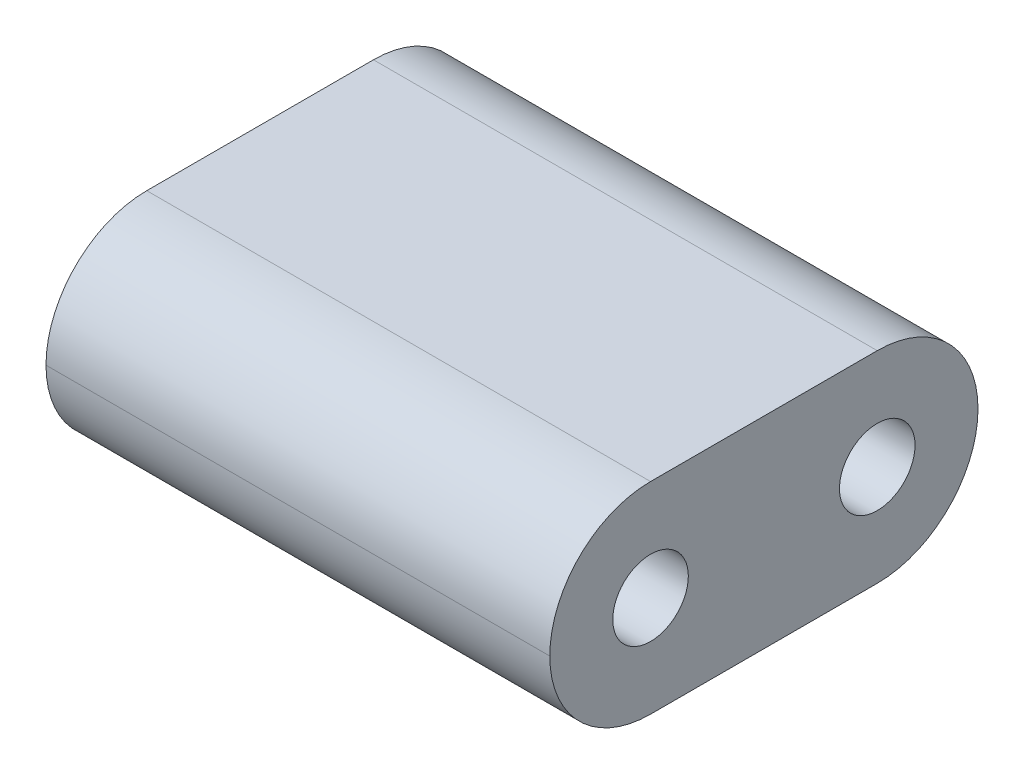
ISO-10303-21;
HEADER;
FILE_DESCRIPTION(('STEP AP214'),'2;1');
FILE_NAME('part.step','',(''),(''),'','','');
FILE_SCHEMA(('AUTOMOTIVE_DESIGN { 1 0 10303 214 1 1 1 1 }'));
ENDSEC;
DATA;
#1=APPLICATION_CONTEXT('core data for automotive mechanical design processes');
#2=APPLICATION_PROTOCOL_DEFINITION('international standard','automotive_design',2000,#1);
#3=PRODUCT_CONTEXT('',#1,'mechanical');
#4=PRODUCT('Part','Part','',(#3));
#5=PRODUCT_RELATED_PRODUCT_CATEGORY('part','',(#4));
#6=PRODUCT_DEFINITION_FORMATION('','',#4);
#7=PRODUCT_DEFINITION_CONTEXT('part definition',#1,'design');
#8=PRODUCT_DEFINITION('design','',#6,#7);
#9=PRODUCT_DEFINITION_SHAPE('','',#8);
#10=(LENGTH_UNIT() NAMED_UNIT(*) SI_UNIT(.MILLI.,.METRE.));
#11=(NAMED_UNIT(*) PLANE_ANGLE_UNIT() SI_UNIT($,.RADIAN.));
#12=(NAMED_UNIT(*) SI_UNIT($,.STERADIAN.) SOLID_ANGLE_UNIT());
#13=UNCERTAINTY_MEASURE_WITH_UNIT(LENGTH_MEASURE(1.E-05),#10,'distance_accuracy_value','');
#14=(GEOMETRIC_REPRESENTATION_CONTEXT(3) GLOBAL_UNCERTAINTY_ASSIGNED_CONTEXT((#13)) GLOBAL_UNIT_ASSIGNED_CONTEXT((#10,
#11,#12)) REPRESENTATION_CONTEXT('',''));
#15=CARTESIAN_POINT('',(0.,0.,0.));
#16=DIRECTION('',(0.,0.,1.));
#17=DIRECTION('',(1.,0.,0.));
#18=AXIS2_PLACEMENT_3D('',#15,#16,#17);
#19=CARTESIAN_POINT('',(0.,5.08,0.));
#20=DIRECTION('',(1.,0.,0.));
#21=DIRECTION('',(0.,0.,-1.));
#22=AXIS2_PLACEMENT_3D('',#19,#20,#21);
#23=PLANE('',#22);
#24=CARTESIAN_POINT('',(0.,2.54,-8.255));
#25=DIRECTION('',(1.,0.,0.));
#26=DIRECTION('',(0.,0.,-1.));
#27=AXIS2_PLACEMENT_3D('',#24,#25,#26);
#28=CIRCLE('',#27,0.9525);
#29=CARTESIAN_POINT('',(0.,2.54,-9.2075));
#30=VERTEX_POINT('',#29);
#31=EDGE_CURVE('E126',#30,#30,#28,.F.);
#32=ORIENTED_EDGE('',*,*,#31,.F.);
#33=EDGE_LOOP('',(#32));
#34=FACE_BOUND('',#33,.T.);
#35=CARTESIAN_POINT('',(0.,2.54,-2.53999999999999));
#36=DIRECTION('',(1.,0.,0.));
#37=DIRECTION('',(0.,0.,-1.));
#38=AXIS2_PLACEMENT_3D('',#35,#36,#37);
#39=CIRCLE('',#38,0.9525);
#40=CARTESIAN_POINT('',(0.,2.54,-3.49249999999999));
#41=VERTEX_POINT('',#40);
#42=EDGE_CURVE('E139',#41,#41,#39,.F.);
#43=ORIENTED_EDGE('',*,*,#42,.F.);
#44=EDGE_LOOP('',(#43));
#45=FACE_BOUND('',#44,.T.);
#46=CARTESIAN_POINT('',(0.,2.54,-8.255));
#47=DIRECTION('',(1.,0.,0.));
#48=DIRECTION('',(0.,0.,-1.));
#49=AXIS2_PLACEMENT_3D('',#46,#47,#48);
#50=CIRCLE('',#49,2.54);
#51=CARTESIAN_POINT('',(0.,5.08,-8.255));
#52=VERTEX_POINT('',#51);
#53=CARTESIAN_POINT('',(0.,2.54,-10.795));
#54=VERTEX_POINT('',#53);
#55=EDGE_CURVE('E110',#52,#54,#50,.F.);
#56=ORIENTED_EDGE('',*,*,#55,.T.);
#57=CARTESIAN_POINT('',(0.,2.54,-8.255));
#58=DIRECTION('',(1.,0.,0.));
#59=DIRECTION('',(0.,0.,-1.));
#60=AXIS2_PLACEMENT_3D('',#57,#58,#59);
#61=CIRCLE('',#60,2.54);
#62=CARTESIAN_POINT('',(0.,0.,-8.255));
#63=VERTEX_POINT('',#62);
#64=EDGE_CURVE('E105',#54,#63,#61,.F.);
#65=ORIENTED_EDGE('',*,*,#64,.T.);
#66=DIRECTION('',(0.,0.,1.));
#67=VECTOR('',#66,1.);
#68=CARTESIAN_POINT('',(0.,0.,0.));
#69=LINE('',#68,#67);
#70=CARTESIAN_POINT('',(0.,0.,-2.54));
#71=VERTEX_POINT('',#70);
#72=EDGE_CURVE('E107',#63,#71,#69,.T.);
#73=ORIENTED_EDGE('',*,*,#72,.T.);
#74=CARTESIAN_POINT('',(0.,2.54,-2.54));
#75=DIRECTION('',(1.,0.,0.));
#76=DIRECTION('',(0.,0.,-1.));
#77=AXIS2_PLACEMENT_3D('',#74,#75,#76);
#78=CIRCLE('',#77,2.54);
#79=CARTESIAN_POINT('',(0.,2.54,0.));
#80=VERTEX_POINT('',#79);
#81=EDGE_CURVE('E147',#71,#80,#78,.F.);
#82=ORIENTED_EDGE('',*,*,#81,.T.);
#83=CARTESIAN_POINT('',(0.,2.54,-2.54));
#84=DIRECTION('',(1.,0.,0.));
#85=DIRECTION('',(0.,0.,-1.));
#86=AXIS2_PLACEMENT_3D('',#83,#84,#85);
#87=CIRCLE('',#86,2.54);
#88=CARTESIAN_POINT('',(0.,5.08,-2.54));
#89=VERTEX_POINT('',#88);
#90=EDGE_CURVE('E151',#80,#89,#87,.F.);
#91=ORIENTED_EDGE('',*,*,#90,.T.);
#92=DIRECTION('',(0.,0.,1.));
#93=VECTOR('',#92,1.);
#94=CARTESIAN_POINT('',(0.,5.08,0.));
#95=LINE('',#94,#93);
#96=EDGE_CURVE('E156',#52,#89,#95,.T.);
#97=ORIENTED_EDGE('',*,*,#96,.F.);
#98=EDGE_LOOP('',(#56,#65,#73,#82,#91,#97));
#99=FACE_BOUND('',#98,.T.);
#100=ADVANCED_FACE('F51',(#34,#45,#99),#23,.F.);
#101=CARTESIAN_POINT('',(12.7,5.08,0.));
#102=DIRECTION('',(-1.,0.,0.));
#103=DIRECTION('',(0.,0.,1.));
#104=AXIS2_PLACEMENT_3D('',#101,#102,#103);
#105=PLANE('',#104);
#106=CARTESIAN_POINT('',(12.7,2.54,-8.255));
#107=DIRECTION('',(1.,0.,0.));
#108=DIRECTION('',(0.,0.,-1.));
#109=AXIS2_PLACEMENT_3D('',#106,#107,#108);
#110=CIRCLE('',#109,0.9525);
#111=CARTESIAN_POINT('',(12.7,2.54,-9.2075));
#112=VERTEX_POINT('',#111);
#113=EDGE_CURVE('E163',#112,#112,#110,.T.);
#114=ORIENTED_EDGE('',*,*,#113,.F.);
#115=EDGE_LOOP('',(#114));
#116=FACE_BOUND('',#115,.T.);
#117=CARTESIAN_POINT('',(12.7,2.54,-2.54));
#118=DIRECTION('',(1.,0.,0.));
#119=DIRECTION('',(0.,0.,-1.));
#120=AXIS2_PLACEMENT_3D('',#117,#118,#119);
#121=CIRCLE('',#120,0.9525);
#122=CARTESIAN_POINT('',(12.7,2.54,-3.4925));
#123=VERTEX_POINT('',#122);
#124=EDGE_CURVE('E141',#123,#123,#121,.T.);
#125=ORIENTED_EDGE('',*,*,#124,.F.);
#126=EDGE_LOOP('',(#125));
#127=FACE_BOUND('',#126,.T.);
#128=DIRECTION('',(0.,0.,-1.));
#129=VECTOR('',#128,1.);
#130=CARTESIAN_POINT('',(12.7,0.,0.));
#131=LINE('',#130,#129);
#132=CARTESIAN_POINT('',(12.7,0.,-2.54));
#133=VERTEX_POINT('',#132);
#134=CARTESIAN_POINT('',(12.7,0.,-8.255));
#135=VERTEX_POINT('',#134);
#136=EDGE_CURVE('E125',#133,#135,#131,.T.);
#137=ORIENTED_EDGE('',*,*,#136,.T.);
#138=CARTESIAN_POINT('',(12.7,2.54,-8.255));
#139=DIRECTION('',(-1.,0.,0.));
#140=DIRECTION('',(0.,0.,1.));
#141=AXIS2_PLACEMENT_3D('',#138,#139,#140);
#142=CIRCLE('',#141,2.54);
#143=CARTESIAN_POINT('',(12.7,2.54,-10.795));
#144=VERTEX_POINT('',#143);
#145=EDGE_CURVE('E129',#135,#144,#142,.F.);
#146=ORIENTED_EDGE('',*,*,#145,.T.);
#147=CARTESIAN_POINT('',(12.7,2.54,-8.255));
#148=DIRECTION('',(-1.,0.,0.));
#149=DIRECTION('',(0.,0.,1.));
#150=AXIS2_PLACEMENT_3D('',#147,#148,#149);
#151=CIRCLE('',#150,2.54);
#152=CARTESIAN_POINT('',(12.7,5.08,-8.255));
#153=VERTEX_POINT('',#152);
#154=EDGE_CURVE('E74',#144,#153,#151,.F.);
#155=ORIENTED_EDGE('',*,*,#154,.T.);
#156=DIRECTION('',(0.,0.,-1.));
#157=VECTOR('',#156,1.);
#158=CARTESIAN_POINT('',(12.7,5.08,0.));
#159=LINE('',#158,#157);
#160=CARTESIAN_POINT('',(12.7,5.08,-2.54));
#161=VERTEX_POINT('',#160);
#162=EDGE_CURVE('E153',#161,#153,#159,.T.);
#163=ORIENTED_EDGE('',*,*,#162,.F.);
#164=CARTESIAN_POINT('',(12.7,2.54,-2.54));
#165=DIRECTION('',(-1.,0.,0.));
#166=DIRECTION('',(0.,0.,1.));
#167=AXIS2_PLACEMENT_3D('',#164,#165,#166);
#168=CIRCLE('',#167,2.54);
#169=CARTESIAN_POINT('',(12.7,2.54,0.));
#170=VERTEX_POINT('',#169);
#171=EDGE_CURVE('E68',#161,#170,#168,.F.);
#172=ORIENTED_EDGE('',*,*,#171,.T.);
#173=CARTESIAN_POINT('',(12.7,2.54,-2.54));
#174=DIRECTION('',(-1.,0.,0.));
#175=DIRECTION('',(0.,0.,1.));
#176=AXIS2_PLACEMENT_3D('',#173,#174,#175);
#177=CIRCLE('',#176,2.54);
#178=EDGE_CURVE('E131',#170,#133,#177,.F.);
#179=ORIENTED_EDGE('',*,*,#178,.T.);
#180=EDGE_LOOP('',(#137,#146,#155,#163,#172,#179));
#181=FACE_BOUND('',#180,.T.);
#182=ADVANCED_FACE('F173',(#116,#127,#181),#105,.F.);
#183=CARTESIAN_POINT('',(0.,5.08,0.));
#184=DIRECTION('',(0.,-1.,0.));
#185=DIRECTION('',(0.,0.,-1.));
#186=AXIS2_PLACEMENT_3D('',#183,#184,#185);
#187=PLANE('',#186);
#188=ORIENTED_EDGE('',*,*,#162,.T.);
#189=DIRECTION('',(-1.,0.,0.));
#190=VECTOR('',#189,1.);
#191=CARTESIAN_POINT('',(0.,5.08,-8.255));
#192=LINE('',#191,#190);
#193=EDGE_CURVE('E12',#153,#52,#192,.T.);
#194=ORIENTED_EDGE('',*,*,#193,.T.);
#195=ORIENTED_EDGE('',*,*,#96,.T.);
#196=DIRECTION('',(1.,0.,0.));
#197=VECTOR('',#196,1.);
#198=CARTESIAN_POINT('',(0.,5.08,-2.54));
#199=LINE('',#198,#197);
#200=EDGE_CURVE('E60',#89,#161,#199,.T.);
#201=ORIENTED_EDGE('',*,*,#200,.T.);
#202=EDGE_LOOP('',(#188,#194,#195,#201));
#203=FACE_BOUND('',#202,.T.);
#204=ADVANCED_FACE('F176',(#203),#187,.F.);
#205=CARTESIAN_POINT('',(0.,0.,0.));
#206=DIRECTION('',(0.,-1.,0.));
#207=DIRECTION('',(0.,0.,-1.));
#208=AXIS2_PLACEMENT_3D('',#205,#206,#207);
#209=PLANE('',#208);
#210=ORIENTED_EDGE('',*,*,#72,.F.);
#211=DIRECTION('',(-1.,0.,0.));
#212=VECTOR('',#211,1.);
#213=CARTESIAN_POINT('',(12.7,0.,-8.255));
#214=LINE('',#213,#212);
#215=EDGE_CURVE('E122',#63,#135,#214,.F.);
#216=ORIENTED_EDGE('',*,*,#215,.T.);
#217=ORIENTED_EDGE('',*,*,#136,.F.);
#218=DIRECTION('',(1.,0.,0.));
#219=VECTOR('',#218,1.);
#220=CARTESIAN_POINT('',(0.,0.,-2.54));
#221=LINE('',#220,#219);
#222=EDGE_CURVE('E115',#133,#71,#221,.F.);
#223=ORIENTED_EDGE('',*,*,#222,.T.);
#224=EDGE_LOOP('',(#210,#216,#217,#223));
#225=FACE_BOUND('',#224,.T.);
#226=ADVANCED_FACE('F120',(#225),#209,.T.);
#227=CARTESIAN_POINT('',(-0.000999999999999265,2.54,-2.53999999999999));
#228=DIRECTION('',(1.,0.,0.));
#229=DIRECTION('',(0.,0.,-1.));
#230=AXIS2_PLACEMENT_3D('',#227,#228,#229);
#231=CYLINDRICAL_SURFACE('',#230,0.9525);
#232=ORIENTED_EDGE('',*,*,#124,.T.);
#233=EDGE_LOOP('',(#232));
#234=FACE_BOUND('',#233,.T.);
#235=ORIENTED_EDGE('',*,*,#42,.T.);
#236=EDGE_LOOP('',(#235));
#237=FACE_BOUND('',#236,.T.);
#238=ADVANCED_FACE('F188',(#234,#237),#231,.F.);
#239=CARTESIAN_POINT('',(-0.001000000000001,2.54,-8.255));
#240=DIRECTION('',(1.,0.,0.));
#241=DIRECTION('',(0.,0.,-1.));
#242=AXIS2_PLACEMENT_3D('',#239,#240,#241);
#243=CYLINDRICAL_SURFACE('',#242,0.9525);
#244=ORIENTED_EDGE('',*,*,#113,.T.);
#245=EDGE_LOOP('',(#244));
#246=FACE_BOUND('',#245,.T.);
#247=ORIENTED_EDGE('',*,*,#31,.T.);
#248=EDGE_LOOP('',(#247));
#249=FACE_BOUND('',#248,.T.);
#250=ADVANCED_FACE('F170',(#246,#249),#243,.F.);
#251=CARTESIAN_POINT('',(0.,2.54,-8.255));
#252=DIRECTION('',(-1.,0.,0.));
#253=DIRECTION('',(0.,0.,1.));
#254=AXIS2_PLACEMENT_3D('',#251,#252,#253);
#255=CYLINDRICAL_SURFACE('',#254,2.54);
#256=ORIENTED_EDGE('',*,*,#193,.F.);
#257=ORIENTED_EDGE('',*,*,#154,.F.);
#258=DIRECTION('',(-1.,0.,0.));
#259=VECTOR('',#258,1.);
#260=CARTESIAN_POINT('',(0.,2.54,-10.795));
#261=LINE('',#260,#259);
#262=EDGE_CURVE('E138',#54,#144,#261,.F.);
#263=ORIENTED_EDGE('',*,*,#262,.F.);
#264=ORIENTED_EDGE('',*,*,#55,.F.);
#265=EDGE_LOOP('',(#256,#257,#263,#264));
#266=FACE_BOUND('',#265,.T.);
#267=ADVANCED_FACE('F181',(#266),#255,.T.);
#268=CARTESIAN_POINT('',(0.,2.54,-8.255));
#269=DIRECTION('',(1.,0.,0.));
#270=DIRECTION('',(0.,0.,-1.));
#271=AXIS2_PLACEMENT_3D('',#268,#269,#270);
#272=CYLINDRICAL_SURFACE('',#271,2.54);
#273=ORIENTED_EDGE('',*,*,#145,.F.);
#274=ORIENTED_EDGE('',*,*,#215,.F.);
#275=ORIENTED_EDGE('',*,*,#64,.F.);
#276=ORIENTED_EDGE('',*,*,#262,.T.);
#277=EDGE_LOOP('',(#273,#274,#275,#276));
#278=FACE_BOUND('',#277,.T.);
#279=ADVANCED_FACE('F128',(#278),#272,.T.);
#280=CARTESIAN_POINT('',(0.,2.54,-2.54));
#281=DIRECTION('',(1.,0.,0.));
#282=DIRECTION('',(0.,0.,-1.));
#283=AXIS2_PLACEMENT_3D('',#280,#281,#282);
#284=CYLINDRICAL_SURFACE('',#283,2.54);
#285=ORIENTED_EDGE('',*,*,#200,.F.);
#286=ORIENTED_EDGE('',*,*,#90,.F.);
#287=DIRECTION('',(1.,0.,0.));
#288=VECTOR('',#287,1.);
#289=CARTESIAN_POINT('',(0.,2.54,0.));
#290=LINE('',#289,#288);
#291=EDGE_CURVE('E55',#170,#80,#290,.F.);
#292=ORIENTED_EDGE('',*,*,#291,.F.);
#293=ORIENTED_EDGE('',*,*,#171,.F.);
#294=EDGE_LOOP('',(#285,#286,#292,#293));
#295=FACE_BOUND('',#294,.T.);
#296=ADVANCED_FACE('F53',(#295),#284,.T.);
#297=CARTESIAN_POINT('',(0.,2.54,-2.54));
#298=DIRECTION('',(-1.,0.,0.));
#299=DIRECTION('',(0.,0.,1.));
#300=AXIS2_PLACEMENT_3D('',#297,#298,#299);
#301=CYLINDRICAL_SURFACE('',#300,2.54);
#302=ORIENTED_EDGE('',*,*,#81,.F.);
#303=ORIENTED_EDGE('',*,*,#222,.F.);
#304=ORIENTED_EDGE('',*,*,#178,.F.);
#305=ORIENTED_EDGE('',*,*,#291,.T.);
#306=EDGE_LOOP('',(#302,#303,#304,#305));
#307=FACE_BOUND('',#306,.T.);
#308=ADVANCED_FACE('F146',(#307),#301,.T.);
#309=CLOSED_SHELL('',(#100,#182,#204,#226,#238,#250,#267,#279,#296,#308));
#310=MANIFOLD_SOLID_BREP('B2',#309);
#311=ADVANCED_BREP_SHAPE_REPRESENTATION('',(#18,#310),#14);
#312=SHAPE_DEFINITION_REPRESENTATION(#9,#311);
ENDSEC;
END-ISO-10303-21;
